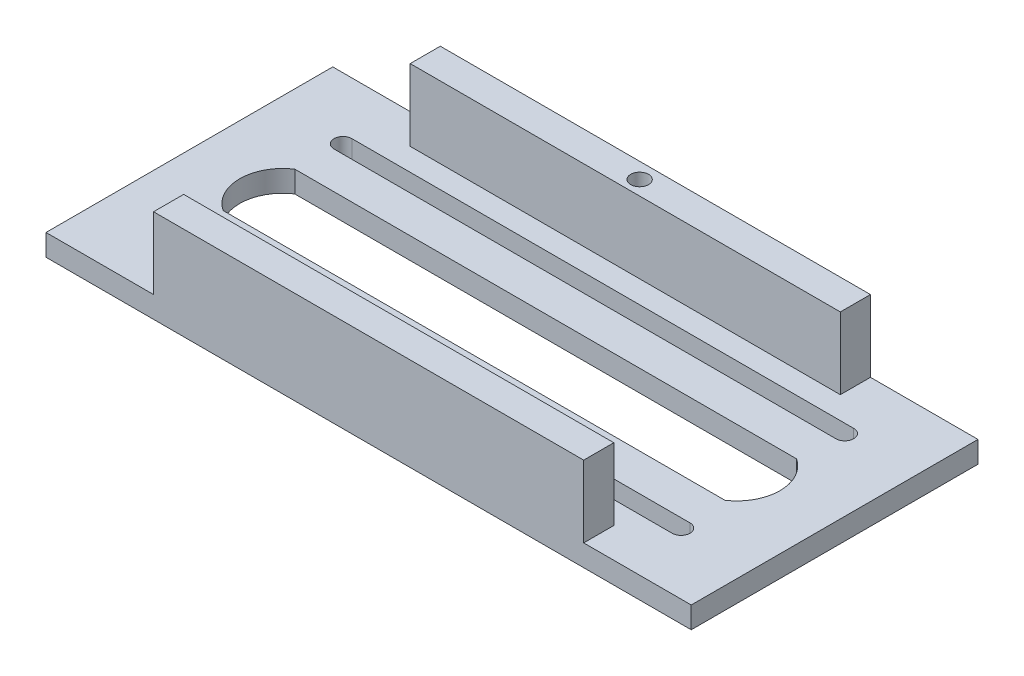
ISO-10303-21;
HEADER;
FILE_DESCRIPTION(('STEP AP214'),'2;1');
FILE_NAME('part.step','',(''),(''),'','','');
FILE_SCHEMA(('AUTOMOTIVE_DESIGN { 1 0 10303 214 1 1 1 1 }'));
ENDSEC;
DATA;
#1=APPLICATION_CONTEXT('core data for automotive mechanical design processes');
#2=APPLICATION_PROTOCOL_DEFINITION('international standard','automotive_design',2000,#1);
#3=PRODUCT_CONTEXT('',#1,'mechanical');
#4=PRODUCT('Part','Part','',(#3));
#5=PRODUCT_RELATED_PRODUCT_CATEGORY('part','',(#4));
#6=PRODUCT_DEFINITION_FORMATION('','',#4);
#7=PRODUCT_DEFINITION_CONTEXT('part definition',#1,'design');
#8=PRODUCT_DEFINITION('design','',#6,#7);
#9=PRODUCT_DEFINITION_SHAPE('','',#8);
#10=(LENGTH_UNIT() NAMED_UNIT(*) SI_UNIT(.MILLI.,.METRE.));
#11=(NAMED_UNIT(*) PLANE_ANGLE_UNIT() SI_UNIT($,.RADIAN.));
#12=(NAMED_UNIT(*) SI_UNIT($,.STERADIAN.) SOLID_ANGLE_UNIT());
#13=UNCERTAINTY_MEASURE_WITH_UNIT(LENGTH_MEASURE(1.E-05),#10,'distance_accuracy_value','');
#14=(GEOMETRIC_REPRESENTATION_CONTEXT(3) GLOBAL_UNCERTAINTY_ASSIGNED_CONTEXT((#13)) GLOBAL_UNIT_ASSIGNED_CONTEXT((#10,
#11,#12)) REPRESENTATION_CONTEXT('',''));
#15=CARTESIAN_POINT('',(0.,0.,0.));
#16=DIRECTION('',(0.,0.,1.));
#17=DIRECTION('',(1.,0.,0.));
#18=AXIS2_PLACEMENT_3D('',#15,#16,#17);
#19=CARTESIAN_POINT('',(0.,7.62,0.));
#20=DIRECTION('',(0.,-1.,0.));
#21=DIRECTION('',(0.,0.,-1.));
#22=AXIS2_PLACEMENT_3D('',#19,#20,#21);
#23=PLANE('',#22);
#24=DIRECTION('',(1.,0.,0.));
#25=VECTOR('',#24,1.);
#26=CARTESIAN_POINT('',(24.6328932167106,7.62,-38.1));
#27=LINE('',#26,#25);
#28=CARTESIAN_POINT('',(24.6328932167106,7.62,-38.1));
#29=VERTEX_POINT('',#28);
#30=CARTESIAN_POINT('',(202.432893216711,7.62,-38.1));
#31=VERTEX_POINT('',#30);
#32=EDGE_CURVE('E224',#29,#31,#27,.T.);
#33=ORIENTED_EDGE('',*,*,#32,.F.);
#34=CARTESIAN_POINT('',(33.0571201842133,7.62,-50.8));
#35=DIRECTION('',(0.,1.,0.));
#36=DIRECTION('',(0.,0.,1.));
#37=AXIS2_PLACEMENT_3D('',#34,#35,#36);
#38=CIRCLE('',#37,15.24);
#39=CARTESIAN_POINT('',(24.6328932167105,7.62,-63.5));
#40=VERTEX_POINT('',#39);
#41=EDGE_CURVE('E48',#40,#29,#38,.T.);
#42=ORIENTED_EDGE('',*,*,#41,.F.);
#43=DIRECTION('',(-1.,0.,0.));
#44=VECTOR('',#43,1.);
#45=CARTESIAN_POINT('',(24.6328932167105,7.62,-63.5));
#46=LINE('',#45,#44);
#47=CARTESIAN_POINT('',(202.432893216711,7.62,-63.5));
#48=VERTEX_POINT('',#47);
#49=EDGE_CURVE('E212',#48,#40,#46,.T.);
#50=ORIENTED_EDGE('',*,*,#49,.F.);
#51=CARTESIAN_POINT('',(194.008666249208,7.62,-50.8));
#52=DIRECTION('',(0.,1.,0.));
#53=DIRECTION('',(0.,0.,-1.));
#54=AXIS2_PLACEMENT_3D('',#51,#52,#53);
#55=CIRCLE('',#54,15.24);
#56=EDGE_CURVE('E215',#31,#48,#55,.T.);
#57=ORIENTED_EDGE('',*,*,#56,.F.);
#58=EDGE_LOOP('',(#33,#42,#50,#57));
#59=FACE_BOUND('',#58,.T.);
#60=DIRECTION('',(1.,0.,0.));
#61=VECTOR('',#60,1.);
#62=CARTESIAN_POINT('',(25.4,7.62,-18.6235998750502));
#63=LINE('',#62,#61);
#64=CARTESIAN_POINT('',(25.4,7.62,-18.6235998750502));
#65=VERTEX_POINT('',#64);
#66=CARTESIAN_POINT('',(203.2,7.62,-18.6235998750502));
#67=VERTEX_POINT('',#66);
#68=EDGE_CURVE('E251',#65,#67,#63,.T.);
#69=ORIENTED_EDGE('',*,*,#68,.F.);
#70=CARTESIAN_POINT('',(25.4,7.62,-21.7985998750502));
#71=DIRECTION('',(0.,1.,0.));
#72=DIRECTION('',(0.,0.,1.));
#73=AXIS2_PLACEMENT_3D('',#70,#71,#72);
#74=CIRCLE('',#73,3.17499999999999);
#75=CARTESIAN_POINT('',(25.4,7.62,-24.9735998750501));
#76=VERTEX_POINT('',#75);
#77=EDGE_CURVE('E249',#76,#65,#74,.T.);
#78=ORIENTED_EDGE('',*,*,#77,.F.);
#79=DIRECTION('',(-1.,0.,0.));
#80=VECTOR('',#79,1.);
#81=CARTESIAN_POINT('',(25.4,7.62,-24.9735998750501));
#82=LINE('',#81,#80);
#83=CARTESIAN_POINT('',(203.2,7.62,-24.9735998750501));
#84=VERTEX_POINT('',#83);
#85=EDGE_CURVE('E239',#84,#76,#82,.T.);
#86=ORIENTED_EDGE('',*,*,#85,.F.);
#87=CARTESIAN_POINT('',(203.2,7.62,-21.7985998750502));
#88=DIRECTION('',(0.,1.,0.));
#89=DIRECTION('',(0.,0.,1.));
#90=AXIS2_PLACEMENT_3D('',#87,#88,#89);
#91=CIRCLE('',#90,3.17499999999999);
#92=EDGE_CURVE('E255',#67,#84,#91,.T.);
#93=ORIENTED_EDGE('',*,*,#92,.F.);
#94=EDGE_LOOP('',(#69,#78,#86,#93));
#95=FACE_BOUND('',#94,.T.);
#96=DIRECTION('',(1.,0.,0.));
#97=VECTOR('',#96,1.);
#98=CARTESIAN_POINT('',(25.4,7.62,-76.6264001249499));
#99=LINE('',#98,#97);
#100=CARTESIAN_POINT('',(25.4,7.62,-76.6264001249499));
#101=VERTEX_POINT('',#100);
#102=CARTESIAN_POINT('',(203.2,7.62,-76.6264001249499));
#103=VERTEX_POINT('',#102);
#104=EDGE_CURVE('E284',#101,#103,#99,.T.);
#105=ORIENTED_EDGE('',*,*,#104,.F.);
#106=CARTESIAN_POINT('',(25.4,7.62,-79.8014001249498));
#107=DIRECTION('',(0.,1.,0.));
#108=DIRECTION('',(0.,0.,-1.));
#109=AXIS2_PLACEMENT_3D('',#106,#107,#108);
#110=CIRCLE('',#109,3.175);
#111=CARTESIAN_POINT('',(25.4,7.62,-82.9764001249498));
#112=VERTEX_POINT('',#111);
#113=EDGE_CURVE('E231',#112,#101,#110,.T.);
#114=ORIENTED_EDGE('',*,*,#113,.F.);
#115=DIRECTION('',(-1.,0.,0.));
#116=VECTOR('',#115,1.);
#117=CARTESIAN_POINT('',(25.4,7.62,-82.9764001249498));
#118=LINE('',#117,#116);
#119=CARTESIAN_POINT('',(203.2,7.62,-82.9764001249498));
#120=VERTEX_POINT('',#119);
#121=EDGE_CURVE('E273',#120,#112,#118,.T.);
#122=ORIENTED_EDGE('',*,*,#121,.F.);
#123=CARTESIAN_POINT('',(203.2,7.62,-79.8014001249498));
#124=DIRECTION('',(0.,1.,0.));
#125=DIRECTION('',(0.,0.,-1.));
#126=AXIS2_PLACEMENT_3D('',#123,#124,#125);
#127=CIRCLE('',#126,3.175);
#128=EDGE_CURVE('E287',#103,#120,#127,.T.);
#129=ORIENTED_EDGE('',*,*,#128,.F.);
#130=EDGE_LOOP('',(#105,#114,#122,#129));
#131=FACE_BOUND('',#130,.T.);
#132=DIRECTION('',(0.,0.,1.));
#133=VECTOR('',#132,1.);
#134=CARTESIAN_POINT('',(38.1,7.62,-10.668));
#135=LINE('',#134,#133);
#136=CARTESIAN_POINT('',(38.1,7.62,-10.668));
#137=VERTEX_POINT('',#136);
#138=CARTESIAN_POINT('',(38.1,7.62,0.));
#139=VERTEX_POINT('',#138);
#140=EDGE_CURVE('E262',#137,#139,#135,.T.);
#141=ORIENTED_EDGE('',*,*,#140,.F.);
#142=DIRECTION('',(-1.,0.,0.));
#143=VECTOR('',#142,1.);
#144=CARTESIAN_POINT('',(190.5,7.62,-10.668));
#145=LINE('',#144,#143);
#146=CARTESIAN_POINT('',(190.5,7.62,-10.668));
#147=VERTEX_POINT('',#146);
#148=EDGE_CURVE('E303',#147,#137,#145,.T.);
#149=ORIENTED_EDGE('',*,*,#148,.F.);
#150=DIRECTION('',(0.,0.,-1.));
#151=VECTOR('',#150,1.);
#152=CARTESIAN_POINT('',(190.5,7.62,-10.668));
#153=LINE('',#152,#151);
#154=CARTESIAN_POINT('',(190.5,7.62,0.));
#155=VERTEX_POINT('',#154);
#156=EDGE_CURVE('E312',#155,#147,#153,.T.);
#157=ORIENTED_EDGE('',*,*,#156,.F.);
#158=DIRECTION('',(1.,0.,0.));
#159=VECTOR('',#158,1.);
#160=CARTESIAN_POINT('',(0.,7.62,0.));
#161=LINE('',#160,#159);
#162=CARTESIAN_POINT('',(228.6,7.62,0.));
#163=VERTEX_POINT('',#162);
#164=EDGE_CURVE('E362',#155,#163,#161,.T.);
#165=ORIENTED_EDGE('',*,*,#164,.T.);
#166=DIRECTION('',(0.,0.,-1.));
#167=VECTOR('',#166,1.);
#168=CARTESIAN_POINT('',(228.6,7.62,0.));
#169=LINE('',#168,#167);
#170=CARTESIAN_POINT('',(228.6,7.62,-101.6));
#171=VERTEX_POINT('',#170);
#172=EDGE_CURVE('E366',#163,#171,#169,.T.);
#173=ORIENTED_EDGE('',*,*,#172,.T.);
#174=DIRECTION('',(-1.,0.,0.));
#175=VECTOR('',#174,1.);
#176=CARTESIAN_POINT('',(0.,7.62,-101.6));
#177=LINE('',#176,#175);
#178=CARTESIAN_POINT('',(190.5,7.62,-101.6));
#179=VERTEX_POINT('',#178);
#180=EDGE_CURVE('E369',#171,#179,#177,.T.);
#181=ORIENTED_EDGE('',*,*,#180,.T.);
#182=DIRECTION('',(0.,0.,-1.));
#183=VECTOR('',#182,1.);
#184=CARTESIAN_POINT('',(190.5,7.62,-101.6));
#185=LINE('',#184,#183);
#186=CARTESIAN_POINT('',(190.5,7.62,-90.932));
#187=VERTEX_POINT('',#186);
#188=EDGE_CURVE('E333',#187,#179,#185,.T.);
#189=ORIENTED_EDGE('',*,*,#188,.F.);
#190=DIRECTION('',(1.,0.,0.));
#191=VECTOR('',#190,1.);
#192=CARTESIAN_POINT('',(190.5,7.62,-90.932));
#193=LINE('',#192,#191);
#194=CARTESIAN_POINT('',(38.1,7.62,-90.932));
#195=VERTEX_POINT('',#194);
#196=EDGE_CURVE('E342',#195,#187,#193,.T.);
#197=ORIENTED_EDGE('',*,*,#196,.F.);
#198=DIRECTION('',(0.,0.,1.));
#199=VECTOR('',#198,1.);
#200=CARTESIAN_POINT('',(38.1,7.62,-101.6));
#201=LINE('',#200,#199);
#202=CARTESIAN_POINT('',(38.1,7.62,-101.6));
#203=VERTEX_POINT('',#202);
#204=EDGE_CURVE('E328',#203,#195,#201,.T.);
#205=ORIENTED_EDGE('',*,*,#204,.F.);
#206=CARTESIAN_POINT('',(0.,7.62,-101.6));
#207=VERTEX_POINT('',#206);
#208=EDGE_CURVE('E368',#203,#207,#177,.T.);
#209=ORIENTED_EDGE('',*,*,#208,.T.);
#210=DIRECTION('',(0.,0.,1.));
#211=VECTOR('',#210,1.);
#212=CARTESIAN_POINT('',(0.,7.62,0.));
#213=LINE('',#212,#211);
#214=CARTESIAN_POINT('',(0.,7.62,0.));
#215=VERTEX_POINT('',#214);
#216=EDGE_CURVE('E359',#207,#215,#213,.T.);
#217=ORIENTED_EDGE('',*,*,#216,.T.);
#218=EDGE_CURVE('E364',#215,#139,#161,.T.);
#219=ORIENTED_EDGE('',*,*,#218,.T.);
#220=EDGE_LOOP('',(#141,#149,#157,#165,#173,#181,#189,#197,#205,#209,#217,#219));
#221=FACE_BOUND('',#220,.T.);
#222=ADVANCED_FACE('F33',(#59,#95,#131,#221),#23,.F.);
#223=CARTESIAN_POINT('',(0.,7.62,0.));
#224=DIRECTION('',(1.,0.,0.));
#225=DIRECTION('',(0.,0.,-1.));
#226=AXIS2_PLACEMENT_3D('',#223,#224,#225);
#227=PLANE('',#226);
#228=DIRECTION('',(0.,0.,1.));
#229=VECTOR('',#228,1.);
#230=CARTESIAN_POINT('',(0.,0.,0.));
#231=LINE('',#230,#229);
#232=CARTESIAN_POINT('',(0.,0.,-101.6));
#233=VERTEX_POINT('',#232);
#234=CARTESIAN_POINT('',(0.,0.,0.));
#235=VERTEX_POINT('',#234);
#236=EDGE_CURVE('E358',#233,#235,#231,.T.);
#237=ORIENTED_EDGE('',*,*,#236,.T.);
#238=DIRECTION('',(0.,-1.,0.));
#239=VECTOR('',#238,1.);
#240=CARTESIAN_POINT('',(0.,7.62,0.));
#241=LINE('',#240,#239);
#242=EDGE_CURVE('E11',#215,#235,#241,.T.);
#243=ORIENTED_EDGE('',*,*,#242,.F.);
#244=ORIENTED_EDGE('',*,*,#216,.F.);
#245=DIRECTION('',(0.,-1.,0.));
#246=VECTOR('',#245,1.);
#247=CARTESIAN_POINT('',(0.,7.62,-101.6));
#248=LINE('',#247,#246);
#249=EDGE_CURVE('E371',#207,#233,#248,.T.);
#250=ORIENTED_EDGE('',*,*,#249,.T.);
#251=EDGE_LOOP('',(#237,#243,#244,#250));
#252=FACE_BOUND('',#251,.T.);
#253=ADVANCED_FACE('F35',(#252),#227,.F.);
#254=CARTESIAN_POINT('',(0.,7.62,0.));
#255=DIRECTION('',(0.,0.,-1.));
#256=DIRECTION('',(-1.,0.,0.));
#257=AXIS2_PLACEMENT_3D('',#254,#255,#256);
#258=PLANE('',#257);
#259=DIRECTION('',(1.,0.,0.));
#260=VECTOR('',#259,1.);
#261=CARTESIAN_POINT('',(0.,0.,0.));
#262=LINE('',#261,#260);
#263=CARTESIAN_POINT('',(228.6,0.,0.));
#264=VERTEX_POINT('',#263);
#265=EDGE_CURVE('E374',#235,#264,#262,.T.);
#266=ORIENTED_EDGE('',*,*,#265,.T.);
#267=DIRECTION('',(0.,-1.,0.));
#268=VECTOR('',#267,1.);
#269=CARTESIAN_POINT('',(228.6,7.62,0.));
#270=LINE('',#269,#268);
#271=EDGE_CURVE('E41',#163,#264,#270,.T.);
#272=ORIENTED_EDGE('',*,*,#271,.F.);
#273=ORIENTED_EDGE('',*,*,#164,.F.);
#274=DIRECTION('',(0.,-1.,0.));
#275=VECTOR('',#274,1.);
#276=CARTESIAN_POINT('',(190.5,33.02,0.));
#277=LINE('',#276,#275);
#278=CARTESIAN_POINT('',(190.5,33.02,0.));
#279=VERTEX_POINT('',#278);
#280=EDGE_CURVE('E322',#279,#155,#277,.T.);
#281=ORIENTED_EDGE('',*,*,#280,.F.);
#282=DIRECTION('',(1.,0.,0.));
#283=VECTOR('',#282,1.);
#284=CARTESIAN_POINT('',(190.5,33.02,0.));
#285=LINE('',#284,#283);
#286=CARTESIAN_POINT('',(38.1,33.02,0.));
#287=VERTEX_POINT('',#286);
#288=EDGE_CURVE('E302',#287,#279,#285,.T.);
#289=ORIENTED_EDGE('',*,*,#288,.F.);
#290=DIRECTION('',(0.,-1.,0.));
#291=VECTOR('',#290,1.);
#292=CARTESIAN_POINT('',(38.1,33.02,0.));
#293=LINE('',#292,#291);
#294=EDGE_CURVE('E325',#287,#139,#293,.T.);
#295=ORIENTED_EDGE('',*,*,#294,.T.);
#296=ORIENTED_EDGE('',*,*,#218,.F.);
#297=ORIENTED_EDGE('',*,*,#242,.T.);
#298=EDGE_LOOP('',(#266,#272,#273,#281,#289,#295,#296,#297));
#299=FACE_BOUND('',#298,.T.);
#300=ADVANCED_FACE('F432',(#299),#258,.F.);
#301=CARTESIAN_POINT('',(228.6,7.62,0.));
#302=DIRECTION('',(-1.,0.,0.));
#303=DIRECTION('',(0.,0.,1.));
#304=AXIS2_PLACEMENT_3D('',#301,#302,#303);
#305=PLANE('',#304);
#306=DIRECTION('',(0.,0.,-1.));
#307=VECTOR('',#306,1.);
#308=CARTESIAN_POINT('',(228.6,0.,0.));
#309=LINE('',#308,#307);
#310=CARTESIAN_POINT('',(228.6,0.,-101.6));
#311=VERTEX_POINT('',#310);
#312=EDGE_CURVE('E376',#264,#311,#309,.T.);
#313=ORIENTED_EDGE('',*,*,#312,.T.);
#314=DIRECTION('',(0.,-1.,0.));
#315=VECTOR('',#314,1.);
#316=CARTESIAN_POINT('',(228.6,7.62,-101.6));
#317=LINE('',#316,#315);
#318=EDGE_CURVE('E381',#171,#311,#317,.T.);
#319=ORIENTED_EDGE('',*,*,#318,.F.);
#320=ORIENTED_EDGE('',*,*,#172,.F.);
#321=ORIENTED_EDGE('',*,*,#271,.T.);
#322=EDGE_LOOP('',(#313,#319,#320,#321));
#323=FACE_BOUND('',#322,.T.);
#324=ADVANCED_FACE('F388',(#323),#305,.F.);
#325=CARTESIAN_POINT('',(0.,7.62,-101.6));
#326=DIRECTION('',(0.,0.,1.));
#327=DIRECTION('',(1.,0.,0.));
#328=AXIS2_PLACEMENT_3D('',#325,#326,#327);
#329=PLANE('',#328);
#330=DIRECTION('',(-1.,0.,0.));
#331=VECTOR('',#330,1.);
#332=CARTESIAN_POINT('',(0.,0.,-101.6));
#333=LINE('',#332,#331);
#334=EDGE_CURVE('E363',#311,#233,#333,.T.);
#335=ORIENTED_EDGE('',*,*,#334,.T.);
#336=ORIENTED_EDGE('',*,*,#249,.F.);
#337=ORIENTED_EDGE('',*,*,#208,.F.);
#338=DIRECTION('',(0.,-1.,0.));
#339=VECTOR('',#338,1.);
#340=CARTESIAN_POINT('',(38.1,33.02,-101.6));
#341=LINE('',#340,#339);
#342=CARTESIAN_POINT('',(38.1,33.02,-101.6));
#343=VERTEX_POINT('',#342);
#344=EDGE_CURVE('E339',#343,#203,#341,.T.);
#345=ORIENTED_EDGE('',*,*,#344,.F.);
#346=DIRECTION('',(-1.,0.,0.));
#347=VECTOR('',#346,1.);
#348=CARTESIAN_POINT('',(190.5,33.02,-101.6));
#349=LINE('',#348,#347);
#350=CARTESIAN_POINT('',(190.5,33.02,-101.6));
#351=VERTEX_POINT('',#350);
#352=EDGE_CURVE('E337',#351,#343,#349,.T.);
#353=ORIENTED_EDGE('',*,*,#352,.F.);
#354=DIRECTION('',(0.,-1.,0.));
#355=VECTOR('',#354,1.);
#356=CARTESIAN_POINT('',(190.5,33.02,-101.6));
#357=LINE('',#356,#355);
#358=EDGE_CURVE('E349',#351,#179,#357,.T.);
#359=ORIENTED_EDGE('',*,*,#358,.T.);
#360=ORIENTED_EDGE('',*,*,#180,.F.);
#361=ORIENTED_EDGE('',*,*,#318,.T.);
#362=EDGE_LOOP('',(#335,#336,#337,#345,#353,#359,#360,#361));
#363=FACE_BOUND('',#362,.T.);
#364=ADVANCED_FACE('F396',(#363),#329,.F.);
#365=CARTESIAN_POINT('',(0.,0.,0.));
#366=DIRECTION('',(0.,-1.,0.));
#367=DIRECTION('',(0.,0.,-1.));
#368=AXIS2_PLACEMENT_3D('',#365,#366,#367);
#369=PLANE('',#368);
#370=CARTESIAN_POINT('',(114.3,0.,-96.012));
#371=DIRECTION('',(0.,-1.,0.));
#372=DIRECTION('',(0.,0.,-1.));
#373=AXIS2_PLACEMENT_3D('',#370,#371,#372);
#374=CIRCLE('',#373,3.175);
#375=CARTESIAN_POINT('',(114.3,0.,-99.187));
#376=VERTEX_POINT('',#375);
#377=EDGE_CURVE('E218',#376,#376,#374,.T.);
#378=ORIENTED_EDGE('',*,*,#377,.F.);
#379=EDGE_LOOP('',(#378));
#380=FACE_BOUND('',#379,.T.);
#381=CARTESIAN_POINT('',(33.0571201842133,0.,-50.8));
#382=DIRECTION('',(0.,1.,0.));
#383=DIRECTION('',(0.,0.,1.));
#384=AXIS2_PLACEMENT_3D('',#381,#382,#383);
#385=CIRCLE('',#384,15.24);
#386=CARTESIAN_POINT('',(24.6328932167105,0.,-63.5));
#387=VERTEX_POINT('',#386);
#388=CARTESIAN_POINT('',(24.6328932167106,0.,-38.1));
#389=VERTEX_POINT('',#388);
#390=EDGE_CURVE('E196',#387,#389,#385,.T.);
#391=ORIENTED_EDGE('',*,*,#390,.T.);
#392=DIRECTION('',(1.,0.,0.));
#393=VECTOR('',#392,1.);
#394=CARTESIAN_POINT('',(24.6328932167106,0.,-38.1));
#395=LINE('',#394,#393);
#396=CARTESIAN_POINT('',(202.432893216711,0.,-38.1));
#397=VERTEX_POINT('',#396);
#398=EDGE_CURVE('E205',#389,#397,#395,.T.);
#399=ORIENTED_EDGE('',*,*,#398,.T.);
#400=CARTESIAN_POINT('',(194.008666249208,0.,-50.8));
#401=DIRECTION('',(0.,1.,0.));
#402=DIRECTION('',(0.,0.,-1.));
#403=AXIS2_PLACEMENT_3D('',#400,#401,#402);
#404=CIRCLE('',#403,15.24);
#405=CARTESIAN_POINT('',(202.432893216711,0.,-63.5));
#406=VERTEX_POINT('',#405);
#407=EDGE_CURVE('E56',#397,#406,#404,.T.);
#408=ORIENTED_EDGE('',*,*,#407,.T.);
#409=DIRECTION('',(-1.,0.,0.));
#410=VECTOR('',#409,1.);
#411=CARTESIAN_POINT('',(24.6328932167105,0.,-63.5));
#412=LINE('',#411,#410);
#413=EDGE_CURVE('E202',#406,#387,#412,.T.);
#414=ORIENTED_EDGE('',*,*,#413,.T.);
#415=EDGE_LOOP('',(#391,#399,#408,#414));
#416=FACE_BOUND('',#415,.T.);
#417=CARTESIAN_POINT('',(25.4,0.,-21.7985998750502));
#418=DIRECTION('',(0.,1.,0.));
#419=DIRECTION('',(0.,0.,1.));
#420=AXIS2_PLACEMENT_3D('',#417,#418,#419);
#421=CIRCLE('',#420,3.17499999999999);
#422=CARTESIAN_POINT('',(25.4,0.,-24.9735998750501));
#423=VERTEX_POINT('',#422);
#424=CARTESIAN_POINT('',(25.4,0.,-18.6235998750502));
#425=VERTEX_POINT('',#424);
#426=EDGE_CURVE('E235',#423,#425,#421,.T.);
#427=ORIENTED_EDGE('',*,*,#426,.T.);
#428=DIRECTION('',(1.,0.,0.));
#429=VECTOR('',#428,1.);
#430=CARTESIAN_POINT('',(25.4,0.,-18.6235998750502));
#431=LINE('',#430,#429);
#432=CARTESIAN_POINT('',(203.2,0.,-18.6235998750502));
#433=VERTEX_POINT('',#432);
#434=EDGE_CURVE('E238',#425,#433,#431,.T.);
#435=ORIENTED_EDGE('',*,*,#434,.T.);
#436=CARTESIAN_POINT('',(203.2,0.,-21.7985998750502));
#437=DIRECTION('',(0.,1.,0.));
#438=DIRECTION('',(0.,0.,1.));
#439=AXIS2_PLACEMENT_3D('',#436,#437,#438);
#440=CIRCLE('',#439,3.17499999999999);
#441=CARTESIAN_POINT('',(203.2,0.,-24.9735998750501));
#442=VERTEX_POINT('',#441);
#443=EDGE_CURVE('E242',#433,#442,#440,.T.);
#444=ORIENTED_EDGE('',*,*,#443,.T.);
#445=DIRECTION('',(-1.,0.,0.));
#446=VECTOR('',#445,1.);
#447=CARTESIAN_POINT('',(25.4,0.,-24.9735998750501));
#448=LINE('',#447,#446);
#449=EDGE_CURVE('E245',#442,#423,#448,.T.);
#450=ORIENTED_EDGE('',*,*,#449,.T.);
#451=EDGE_LOOP('',(#427,#435,#444,#450));
#452=FACE_BOUND('',#451,.T.);
#453=CARTESIAN_POINT('',(25.4,0.,-79.8014001249498));
#454=DIRECTION('',(0.,1.,0.));
#455=DIRECTION('',(0.,0.,-1.));
#456=AXIS2_PLACEMENT_3D('',#453,#454,#455);
#457=CIRCLE('',#456,3.175);
#458=CARTESIAN_POINT('',(25.4,0.,-82.9764001249498));
#459=VERTEX_POINT('',#458);
#460=CARTESIAN_POINT('',(25.4,0.,-76.6264001249499));
#461=VERTEX_POINT('',#460);
#462=EDGE_CURVE('E269',#459,#461,#457,.T.);
#463=ORIENTED_EDGE('',*,*,#462,.T.);
#464=DIRECTION('',(1.,0.,0.));
#465=VECTOR('',#464,1.);
#466=CARTESIAN_POINT('',(25.4,0.,-76.6264001249499));
#467=LINE('',#466,#465);
#468=CARTESIAN_POINT('',(203.2,0.,-76.6264001249499));
#469=VERTEX_POINT('',#468);
#470=EDGE_CURVE('E272',#461,#469,#467,.T.);
#471=ORIENTED_EDGE('',*,*,#470,.T.);
#472=CARTESIAN_POINT('',(203.2,0.,-79.8014001249498));
#473=DIRECTION('',(0.,1.,0.));
#474=DIRECTION('',(0.,0.,-1.));
#475=AXIS2_PLACEMENT_3D('',#472,#473,#474);
#476=CIRCLE('',#475,3.175);
#477=CARTESIAN_POINT('',(203.2,0.,-82.9764001249498));
#478=VERTEX_POINT('',#477);
#479=EDGE_CURVE('E276',#469,#478,#476,.T.);
#480=ORIENTED_EDGE('',*,*,#479,.T.);
#481=DIRECTION('',(-1.,0.,0.));
#482=VECTOR('',#481,1.);
#483=CARTESIAN_POINT('',(25.4,0.,-82.9764001249498));
#484=LINE('',#483,#482);
#485=EDGE_CURVE('E279',#478,#459,#484,.T.);
#486=ORIENTED_EDGE('',*,*,#485,.T.);
#487=EDGE_LOOP('',(#463,#471,#480,#486));
#488=FACE_BOUND('',#487,.T.);
#489=ORIENTED_EDGE('',*,*,#236,.F.);
#490=ORIENTED_EDGE('',*,*,#334,.F.);
#491=ORIENTED_EDGE('',*,*,#312,.F.);
#492=ORIENTED_EDGE('',*,*,#265,.F.);
#493=EDGE_LOOP('',(#489,#490,#491,#492));
#494=FACE_BOUND('',#493,.T.);
#495=ADVANCED_FACE('F209',(#380,#416,#452,#488,#494),#369,.T.);
#496=CARTESIAN_POINT('',(38.1,33.02,-101.6));
#497=DIRECTION('',(1.,0.,0.));
#498=DIRECTION('',(0.,0.,-1.));
#499=AXIS2_PLACEMENT_3D('',#496,#497,#498);
#500=PLANE('',#499);
#501=ORIENTED_EDGE('',*,*,#204,.T.);
#502=DIRECTION('',(0.,-1.,0.));
#503=VECTOR('',#502,1.);
#504=CARTESIAN_POINT('',(38.1,33.02,-90.932));
#505=LINE('',#504,#503);
#506=CARTESIAN_POINT('',(38.1,33.02,-90.932));
#507=VERTEX_POINT('',#506);
#508=EDGE_CURVE('E355',#507,#195,#505,.T.);
#509=ORIENTED_EDGE('',*,*,#508,.F.);
#510=DIRECTION('',(0.,0.,1.));
#511=VECTOR('',#510,1.);
#512=CARTESIAN_POINT('',(38.1,33.02,-101.6));
#513=LINE('',#512,#511);
#514=EDGE_CURVE('E329',#343,#507,#513,.T.);
#515=ORIENTED_EDGE('',*,*,#514,.F.);
#516=ORIENTED_EDGE('',*,*,#344,.T.);
#517=EDGE_LOOP('',(#501,#509,#515,#516));
#518=FACE_BOUND('',#517,.T.);
#519=ADVANCED_FACE('F407',(#518),#500,.F.);
#520=CARTESIAN_POINT('',(190.5,33.02,-90.932));
#521=DIRECTION('',(0.,0.,-1.));
#522=DIRECTION('',(-1.,0.,0.));
#523=AXIS2_PLACEMENT_3D('',#520,#521,#522);
#524=PLANE('',#523);
#525=ORIENTED_EDGE('',*,*,#196,.T.);
#526=DIRECTION('',(0.,-1.,0.));
#527=VECTOR('',#526,1.);
#528=CARTESIAN_POINT('',(190.5,33.02,-90.932));
#529=LINE('',#528,#527);
#530=CARTESIAN_POINT('',(190.5,33.02,-90.932));
#531=VERTEX_POINT('',#530);
#532=EDGE_CURVE('E352',#531,#187,#529,.T.);
#533=ORIENTED_EDGE('',*,*,#532,.F.);
#534=DIRECTION('',(1.,0.,0.));
#535=VECTOR('',#534,1.);
#536=CARTESIAN_POINT('',(190.5,33.02,-90.932));
#537=LINE('',#536,#535);
#538=EDGE_CURVE('E332',#507,#531,#537,.T.);
#539=ORIENTED_EDGE('',*,*,#538,.F.);
#540=ORIENTED_EDGE('',*,*,#508,.T.);
#541=EDGE_LOOP('',(#525,#533,#539,#540));
#542=FACE_BOUND('',#541,.T.);
#543=ADVANCED_FACE('F417',(#542),#524,.F.);
#544=CARTESIAN_POINT('',(190.5,33.02,-101.6));
#545=DIRECTION('',(-1.,0.,0.));
#546=DIRECTION('',(0.,0.,1.));
#547=AXIS2_PLACEMENT_3D('',#544,#545,#546);
#548=PLANE('',#547);
#549=ORIENTED_EDGE('',*,*,#188,.T.);
#550=ORIENTED_EDGE('',*,*,#358,.F.);
#551=DIRECTION('',(0.,0.,-1.));
#552=VECTOR('',#551,1.);
#553=CARTESIAN_POINT('',(190.5,33.02,-101.6));
#554=LINE('',#553,#552);
#555=EDGE_CURVE('E335',#531,#351,#554,.T.);
#556=ORIENTED_EDGE('',*,*,#555,.F.);
#557=ORIENTED_EDGE('',*,*,#532,.T.);
#558=EDGE_LOOP('',(#549,#550,#556,#557));
#559=FACE_BOUND('',#558,.T.);
#560=ADVANCED_FACE('F415',(#559),#548,.F.);
#561=CARTESIAN_POINT('',(0.,33.02,0.));
#562=DIRECTION('',(0.,-1.,0.));
#563=DIRECTION('',(0.,0.,-1.));
#564=AXIS2_PLACEMENT_3D('',#561,#562,#563);
#565=PLANE('',#564);
#566=CARTESIAN_POINT('',(114.3,33.02,-96.012));
#567=DIRECTION('',(0.,-1.,0.));
#568=DIRECTION('',(0.,0.,-1.));
#569=AXIS2_PLACEMENT_3D('',#566,#567,#568);
#570=CIRCLE('',#569,3.175);
#571=CARTESIAN_POINT('',(114.3,33.02,-99.187));
#572=VERTEX_POINT('',#571);
#573=EDGE_CURVE('E225',#572,#572,#570,.T.);
#574=ORIENTED_EDGE('',*,*,#573,.T.);
#575=EDGE_LOOP('',(#574));
#576=FACE_BOUND('',#575,.T.);
#577=ORIENTED_EDGE('',*,*,#514,.T.);
#578=ORIENTED_EDGE('',*,*,#538,.T.);
#579=ORIENTED_EDGE('',*,*,#555,.T.);
#580=ORIENTED_EDGE('',*,*,#352,.T.);
#581=EDGE_LOOP('',(#577,#578,#579,#580));
#582=FACE_BOUND('',#581,.T.);
#583=ADVANCED_FACE('F410',(#576,#582),#565,.F.);
#584=CARTESIAN_POINT('',(38.1,33.02,-10.668));
#585=DIRECTION('',(1.,0.,0.));
#586=DIRECTION('',(0.,0.,-1.));
#587=AXIS2_PLACEMENT_3D('',#584,#585,#586);
#588=PLANE('',#587);
#589=ORIENTED_EDGE('',*,*,#140,.T.);
#590=ORIENTED_EDGE('',*,*,#294,.F.);
#591=DIRECTION('',(0.,0.,1.));
#592=VECTOR('',#591,1.);
#593=CARTESIAN_POINT('',(38.1,33.02,-10.668));
#594=LINE('',#593,#592);
#595=CARTESIAN_POINT('',(38.1,33.02,-10.668));
#596=VERTEX_POINT('',#595);
#597=EDGE_CURVE('E299',#596,#287,#594,.T.);
#598=ORIENTED_EDGE('',*,*,#597,.F.);
#599=DIRECTION('',(0.,-1.,0.));
#600=VECTOR('',#599,1.);
#601=CARTESIAN_POINT('',(38.1,33.02,-10.668));
#602=LINE('',#601,#600);
#603=EDGE_CURVE('E309',#596,#137,#602,.T.);
#604=ORIENTED_EDGE('',*,*,#603,.T.);
#605=EDGE_LOOP('',(#589,#590,#598,#604));
#606=FACE_BOUND('',#605,.T.);
#607=ADVANCED_FACE('F448',(#606),#588,.F.);
#608=CARTESIAN_POINT('',(190.5,33.02,-10.668));
#609=DIRECTION('',(-1.,0.,0.));
#610=DIRECTION('',(0.,0.,1.));
#611=AXIS2_PLACEMENT_3D('',#608,#609,#610);
#612=PLANE('',#611);
#613=ORIENTED_EDGE('',*,*,#156,.T.);
#614=DIRECTION('',(0.,-1.,0.));
#615=VECTOR('',#614,1.);
#616=CARTESIAN_POINT('',(190.5,33.02,-10.668));
#617=LINE('',#616,#615);
#618=CARTESIAN_POINT('',(190.5,33.02,-10.668));
#619=VERTEX_POINT('',#618);
#620=EDGE_CURVE('E319',#619,#147,#617,.T.);
#621=ORIENTED_EDGE('',*,*,#620,.F.);
#622=DIRECTION('',(0.,0.,-1.));
#623=VECTOR('',#622,1.);
#624=CARTESIAN_POINT('',(190.5,33.02,-10.668));
#625=LINE('',#624,#623);
#626=EDGE_CURVE('E305',#279,#619,#625,.T.);
#627=ORIENTED_EDGE('',*,*,#626,.F.);
#628=ORIENTED_EDGE('',*,*,#280,.T.);
#629=EDGE_LOOP('',(#613,#621,#627,#628));
#630=FACE_BOUND('',#629,.T.);
#631=ADVANCED_FACE('F457',(#630),#612,.F.);
#632=CARTESIAN_POINT('',(190.5,33.02,-10.668));
#633=DIRECTION('',(0.,0.,1.));
#634=DIRECTION('',(1.,0.,0.));
#635=AXIS2_PLACEMENT_3D('',#632,#633,#634);
#636=PLANE('',#635);
#637=ORIENTED_EDGE('',*,*,#148,.T.);
#638=ORIENTED_EDGE('',*,*,#603,.F.);
#639=DIRECTION('',(-1.,0.,0.));
#640=VECTOR('',#639,1.);
#641=CARTESIAN_POINT('',(190.5,33.02,-10.668));
#642=LINE('',#641,#640);
#643=EDGE_CURVE('E307',#619,#596,#642,.T.);
#644=ORIENTED_EDGE('',*,*,#643,.F.);
#645=ORIENTED_EDGE('',*,*,#620,.T.);
#646=EDGE_LOOP('',(#637,#638,#644,#645));
#647=FACE_BOUND('',#646,.T.);
#648=ADVANCED_FACE('F452',(#647),#636,.F.);
#649=CARTESIAN_POINT('',(0.,33.02,0.));
#650=DIRECTION('',(0.,-1.,0.));
#651=DIRECTION('',(0.,0.,-1.));
#652=AXIS2_PLACEMENT_3D('',#649,#650,#651);
#653=PLANE('',#652);
#654=ORIENTED_EDGE('',*,*,#597,.T.);
#655=ORIENTED_EDGE('',*,*,#288,.T.);
#656=ORIENTED_EDGE('',*,*,#626,.T.);
#657=ORIENTED_EDGE('',*,*,#643,.T.);
#658=EDGE_LOOP('',(#654,#655,#656,#657));
#659=FACE_BOUND('',#658,.T.);
#660=ADVANCED_FACE('F459',(#659),#653,.F.);
#661=CARTESIAN_POINT('',(25.4,0.,-79.8014001249498));
#662=DIRECTION('',(0.,1.,0.));
#663=DIRECTION('',(0.,0.,1.));
#664=AXIS2_PLACEMENT_3D('',#661,#662,#663);
#665=CYLINDRICAL_SURFACE('',#664,3.175);
#666=ORIENTED_EDGE('',*,*,#113,.T.);
#667=DIRECTION('',(0.,1.,0.));
#668=VECTOR('',#667,1.);
#669=CARTESIAN_POINT('',(25.4,0.,-76.6264001249499));
#670=LINE('',#669,#668);
#671=EDGE_CURVE('E282',#461,#101,#670,.T.);
#672=ORIENTED_EDGE('',*,*,#671,.F.);
#673=ORIENTED_EDGE('',*,*,#462,.F.);
#674=DIRECTION('',(0.,1.,0.));
#675=VECTOR('',#674,1.);
#676=CARTESIAN_POINT('',(25.4,0.,-82.9764001249498));
#677=LINE('',#676,#675);
#678=EDGE_CURVE('E252',#459,#112,#677,.T.);
#679=ORIENTED_EDGE('',*,*,#678,.T.);
#680=EDGE_LOOP('',(#666,#672,#673,#679));
#681=FACE_BOUND('',#680,.T.);
#682=ADVANCED_FACE('F461',(#681),#665,.F.);
#683=CARTESIAN_POINT('',(25.4,0.,-82.9764001249498));
#684=DIRECTION('',(0.,0.,-1.));
#685=DIRECTION('',(-1.,0.,0.));
#686=AXIS2_PLACEMENT_3D('',#683,#684,#685);
#687=PLANE('',#686);
#688=ORIENTED_EDGE('',*,*,#121,.T.);
#689=ORIENTED_EDGE('',*,*,#678,.F.);
#690=ORIENTED_EDGE('',*,*,#485,.F.);
#691=DIRECTION('',(0.,1.,0.));
#692=VECTOR('',#691,1.);
#693=CARTESIAN_POINT('',(203.2,0.,-82.9764001249498));
#694=LINE('',#693,#692);
#695=EDGE_CURVE('E293',#478,#120,#694,.T.);
#696=ORIENTED_EDGE('',*,*,#695,.T.);
#697=EDGE_LOOP('',(#688,#689,#690,#696));
#698=FACE_BOUND('',#697,.T.);
#699=ADVANCED_FACE('F467',(#698),#687,.F.);
#700=CARTESIAN_POINT('',(203.2,0.,-79.8014001249498));
#701=DIRECTION('',(0.,1.,0.));
#702=DIRECTION('',(0.,0.,1.));
#703=AXIS2_PLACEMENT_3D('',#700,#701,#702);
#704=CYLINDRICAL_SURFACE('',#703,3.175);
#705=ORIENTED_EDGE('',*,*,#128,.T.);
#706=ORIENTED_EDGE('',*,*,#695,.F.);
#707=ORIENTED_EDGE('',*,*,#479,.F.);
#708=DIRECTION('',(0.,1.,0.));
#709=VECTOR('',#708,1.);
#710=CARTESIAN_POINT('',(203.2,0.,-76.6264001249499));
#711=LINE('',#710,#709);
#712=EDGE_CURVE('E295',#469,#103,#711,.T.);
#713=ORIENTED_EDGE('',*,*,#712,.T.);
#714=EDGE_LOOP('',(#705,#706,#707,#713));
#715=FACE_BOUND('',#714,.T.);
#716=ADVANCED_FACE('F523',(#715),#704,.F.);
#717=CARTESIAN_POINT('',(25.4,0.,-76.6264001249499));
#718=DIRECTION('',(0.,0.,1.));
#719=DIRECTION('',(1.,0.,0.));
#720=AXIS2_PLACEMENT_3D('',#717,#718,#719);
#721=PLANE('',#720);
#722=ORIENTED_EDGE('',*,*,#104,.T.);
#723=ORIENTED_EDGE('',*,*,#712,.F.);
#724=ORIENTED_EDGE('',*,*,#470,.F.);
#725=ORIENTED_EDGE('',*,*,#671,.T.);
#726=EDGE_LOOP('',(#722,#723,#724,#725));
#727=FACE_BOUND('',#726,.T.);
#728=ADVANCED_FACE('F519',(#727),#721,.F.);
#729=CARTESIAN_POINT('',(25.4,0.,-21.7985998750502));
#730=DIRECTION('',(0.,1.,0.));
#731=DIRECTION('',(0.,0.,1.));
#732=AXIS2_PLACEMENT_3D('',#729,#730,#731);
#733=CYLINDRICAL_SURFACE('',#732,3.17499999999999);
#734=ORIENTED_EDGE('',*,*,#77,.T.);
#735=DIRECTION('',(0.,1.,0.));
#736=VECTOR('',#735,1.);
#737=CARTESIAN_POINT('',(25.4,0.,-18.6235998750502));
#738=LINE('',#737,#736);
#739=EDGE_CURVE('E248',#425,#65,#738,.T.);
#740=ORIENTED_EDGE('',*,*,#739,.F.);
#741=ORIENTED_EDGE('',*,*,#426,.F.);
#742=DIRECTION('',(0.,1.,0.));
#743=VECTOR('',#742,1.);
#744=CARTESIAN_POINT('',(25.4,0.,-24.9735998750501));
#745=LINE('',#744,#743);
#746=EDGE_CURVE('E260',#423,#76,#745,.T.);
#747=ORIENTED_EDGE('',*,*,#746,.T.);
#748=EDGE_LOOP('',(#734,#740,#741,#747));
#749=FACE_BOUND('',#748,.T.);
#750=ADVANCED_FACE('F509',(#749),#733,.F.);
#751=CARTESIAN_POINT('',(25.4,0.,-24.9735998750501));
#752=DIRECTION('',(0.,0.,-1.));
#753=DIRECTION('',(-1.,0.,0.));
#754=AXIS2_PLACEMENT_3D('',#751,#752,#753);
#755=PLANE('',#754);
#756=ORIENTED_EDGE('',*,*,#85,.T.);
#757=ORIENTED_EDGE('',*,*,#746,.F.);
#758=ORIENTED_EDGE('',*,*,#449,.F.);
#759=DIRECTION('',(0.,1.,0.));
#760=VECTOR('',#759,1.);
#761=CARTESIAN_POINT('',(203.2,0.,-24.9735998750501));
#762=LINE('',#761,#760);
#763=EDGE_CURVE('E263',#442,#84,#762,.T.);
#764=ORIENTED_EDGE('',*,*,#763,.T.);
#765=EDGE_LOOP('',(#756,#757,#758,#764));
#766=FACE_BOUND('',#765,.T.);
#767=ADVANCED_FACE('F505',(#766),#755,.F.);
#768=CARTESIAN_POINT('',(203.2,0.,-21.7985998750502));
#769=DIRECTION('',(0.,1.,0.));
#770=DIRECTION('',(0.,0.,1.));
#771=AXIS2_PLACEMENT_3D('',#768,#769,#770);
#772=CYLINDRICAL_SURFACE('',#771,3.17499999999999);
#773=ORIENTED_EDGE('',*,*,#92,.T.);
#774=ORIENTED_EDGE('',*,*,#763,.F.);
#775=ORIENTED_EDGE('',*,*,#443,.F.);
#776=DIRECTION('',(0.,1.,0.));
#777=VECTOR('',#776,1.);
#778=CARTESIAN_POINT('',(203.2,0.,-18.6235998750502));
#779=LINE('',#778,#777);
#780=EDGE_CURVE('E265',#433,#67,#779,.T.);
#781=ORIENTED_EDGE('',*,*,#780,.T.);
#782=EDGE_LOOP('',(#773,#774,#775,#781));
#783=FACE_BOUND('',#782,.T.);
#784=ADVANCED_FACE('F508',(#783),#772,.F.);
#785=CARTESIAN_POINT('',(25.4,0.,-18.6235998750502));
#786=DIRECTION('',(0.,0.,1.));
#787=DIRECTION('',(1.,0.,0.));
#788=AXIS2_PLACEMENT_3D('',#785,#786,#787);
#789=PLANE('',#788);
#790=ORIENTED_EDGE('',*,*,#68,.T.);
#791=ORIENTED_EDGE('',*,*,#780,.F.);
#792=ORIENTED_EDGE('',*,*,#434,.F.);
#793=ORIENTED_EDGE('',*,*,#739,.T.);
#794=EDGE_LOOP('',(#790,#791,#792,#793));
#795=FACE_BOUND('',#794,.T.);
#796=ADVANCED_FACE('F504',(#795),#789,.F.);
#797=CARTESIAN_POINT('',(33.0571201842133,0.,-50.8));
#798=DIRECTION('',(0.,1.,0.));
#799=DIRECTION('',(0.,0.,1.));
#800=AXIS2_PLACEMENT_3D('',#797,#798,#799);
#801=CYLINDRICAL_SURFACE('',#800,15.24);
#802=ORIENTED_EDGE('',*,*,#41,.T.);
#803=DIRECTION('',(0.,1.,0.));
#804=VECTOR('',#803,1.);
#805=CARTESIAN_POINT('',(24.6328932167106,0.,-38.1));
#806=LINE('',#805,#804);
#807=EDGE_CURVE('E192',#389,#29,#806,.T.);
#808=ORIENTED_EDGE('',*,*,#807,.F.);
#809=ORIENTED_EDGE('',*,*,#390,.F.);
#810=DIRECTION('',(0.,1.,0.));
#811=VECTOR('',#810,1.);
#812=CARTESIAN_POINT('',(24.6328932167105,0.,-63.5));
#813=LINE('',#812,#811);
#814=EDGE_CURVE('E229',#387,#40,#813,.T.);
#815=ORIENTED_EDGE('',*,*,#814,.T.);
#816=EDGE_LOOP('',(#802,#808,#809,#815));
#817=FACE_BOUND('',#816,.T.);
#818=ADVANCED_FACE('F194',(#817),#801,.F.);
#819=CARTESIAN_POINT('',(24.6328932167105,0.,-63.5));
#820=DIRECTION('',(0.,0.,-1.));
#821=DIRECTION('',(-1.,0.,0.));
#822=AXIS2_PLACEMENT_3D('',#819,#820,#821);
#823=PLANE('',#822);
#824=ORIENTED_EDGE('',*,*,#49,.T.);
#825=ORIENTED_EDGE('',*,*,#814,.F.);
#826=ORIENTED_EDGE('',*,*,#413,.F.);
#827=DIRECTION('',(0.,1.,0.));
#828=VECTOR('',#827,1.);
#829=CARTESIAN_POINT('',(202.432893216711,0.,-63.5));
#830=LINE('',#829,#828);
#831=EDGE_CURVE('E232',#406,#48,#830,.T.);
#832=ORIENTED_EDGE('',*,*,#831,.T.);
#833=EDGE_LOOP('',(#824,#825,#826,#832));
#834=FACE_BOUND('',#833,.T.);
#835=ADVANCED_FACE('F496',(#834),#823,.F.);
#836=CARTESIAN_POINT('',(194.008666249208,0.,-50.8));
#837=DIRECTION('',(0.,1.,0.));
#838=DIRECTION('',(0.,0.,1.));
#839=AXIS2_PLACEMENT_3D('',#836,#837,#838);
#840=CYLINDRICAL_SURFACE('',#839,15.24);
#841=ORIENTED_EDGE('',*,*,#56,.T.);
#842=ORIENTED_EDGE('',*,*,#831,.F.);
#843=ORIENTED_EDGE('',*,*,#407,.F.);
#844=DIRECTION('',(0.,1.,0.));
#845=VECTOR('',#844,1.);
#846=CARTESIAN_POINT('',(202.432893216711,0.,-38.1));
#847=LINE('',#846,#845);
#848=EDGE_CURVE('E201',#397,#31,#847,.T.);
#849=ORIENTED_EDGE('',*,*,#848,.T.);
#850=EDGE_LOOP('',(#841,#842,#843,#849));
#851=FACE_BOUND('',#850,.T.);
#852=ADVANCED_FACE('F493',(#851),#840,.F.);
#853=CARTESIAN_POINT('',(24.6328932167106,0.,-38.1));
#854=DIRECTION('',(0.,0.,1.));
#855=DIRECTION('',(1.,0.,0.));
#856=AXIS2_PLACEMENT_3D('',#853,#854,#855);
#857=PLANE('',#856);
#858=ORIENTED_EDGE('',*,*,#32,.T.);
#859=ORIENTED_EDGE('',*,*,#848,.F.);
#860=ORIENTED_EDGE('',*,*,#398,.F.);
#861=ORIENTED_EDGE('',*,*,#807,.T.);
#862=EDGE_LOOP('',(#858,#859,#860,#861));
#863=FACE_BOUND('',#862,.T.);
#864=ADVANCED_FACE('F206',(#863),#857,.F.);
#865=CARTESIAN_POINT('',(114.3,33.02,-96.012));
#866=DIRECTION('',(0.,-1.,0.));
#867=DIRECTION('',(0.,0.,-1.));
#868=AXIS2_PLACEMENT_3D('',#865,#866,#867);
#869=CYLINDRICAL_SURFACE('',#868,3.175);
#870=ORIENTED_EDGE('',*,*,#573,.F.);
#871=EDGE_LOOP('',(#870));
#872=FACE_BOUND('',#871,.T.);
#873=ORIENTED_EDGE('',*,*,#377,.T.);
#874=EDGE_LOOP('',(#873));
#875=FACE_BOUND('',#874,.T.);
#876=ADVANCED_FACE('F487',(#872,#875),#869,.F.);
#877=CLOSED_SHELL('',(#222,#253,#300,#324,#364,#495,#519,#543,#560,#583,#607,#631,#648,#660,
#682,#699,#716,#728,#750,#767,#784,#796,#818,#835,#852,#864,#876));
#878=MANIFOLD_SOLID_BREP('B2',#877);
#879=ADVANCED_BREP_SHAPE_REPRESENTATION('',(#18,#878),#14);
#880=SHAPE_DEFINITION_REPRESENTATION(#9,#879);
ENDSEC;
END-ISO-10303-21;
